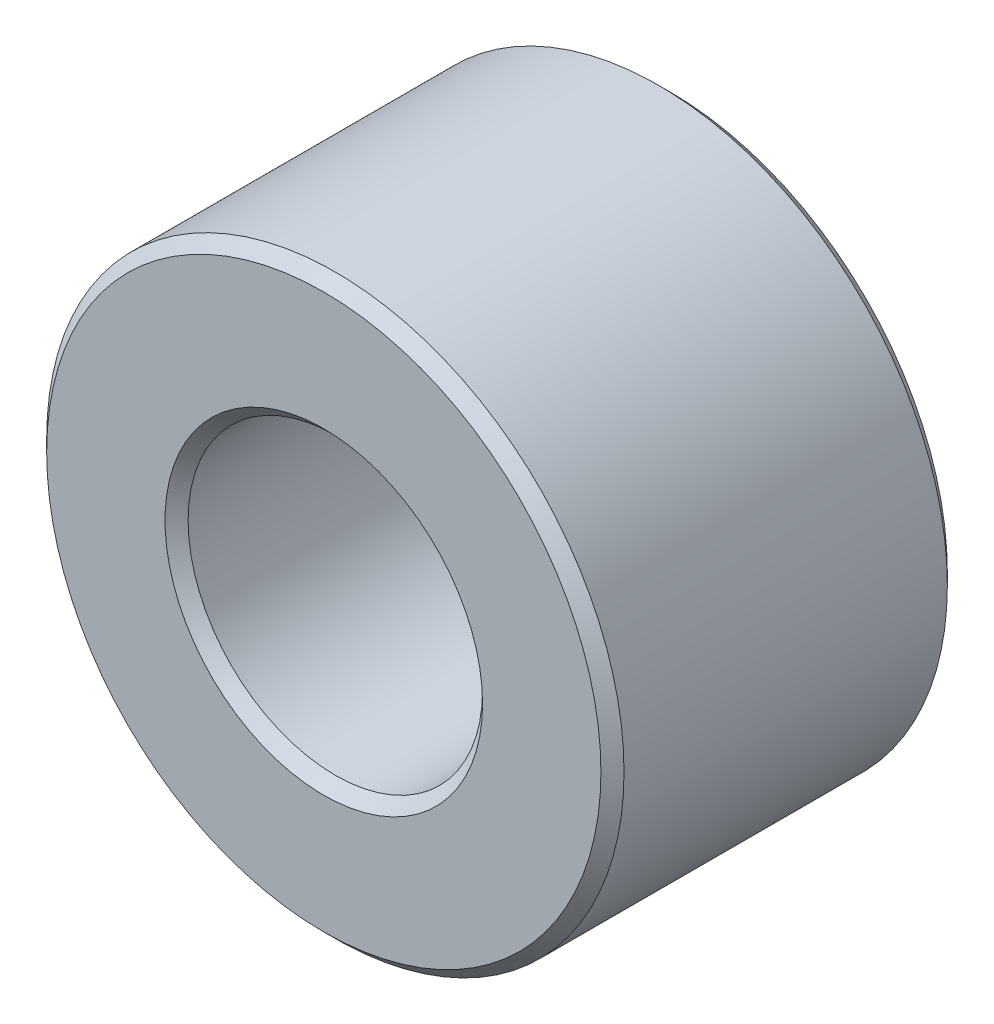
ISO-10303-21;
HEADER;
FILE_DESCRIPTION(('STEP AP214'),'2;1');
FILE_NAME('part.step','',(''),(''),'','','');
FILE_SCHEMA(('AUTOMOTIVE_DESIGN { 1 0 10303 214 1 1 1 1 }'));
ENDSEC;
DATA;
#1=APPLICATION_CONTEXT('core data for automotive mechanical design processes');
#2=APPLICATION_PROTOCOL_DEFINITION('international standard','automotive_design',2000,#1);
#3=PRODUCT_CONTEXT('',#1,'mechanical');
#4=PRODUCT('Part','Part','',(#3));
#5=PRODUCT_RELATED_PRODUCT_CATEGORY('part','',(#4));
#6=PRODUCT_DEFINITION_FORMATION('','',#4);
#7=PRODUCT_DEFINITION_CONTEXT('part definition',#1,'design');
#8=PRODUCT_DEFINITION('design','',#6,#7);
#9=PRODUCT_DEFINITION_SHAPE('','',#8);
#10=(LENGTH_UNIT() NAMED_UNIT(*) SI_UNIT(.MILLI.,.METRE.));
#11=(NAMED_UNIT(*) PLANE_ANGLE_UNIT() SI_UNIT($,.RADIAN.));
#12=(NAMED_UNIT(*) SI_UNIT($,.STERADIAN.) SOLID_ANGLE_UNIT());
#13=UNCERTAINTY_MEASURE_WITH_UNIT(LENGTH_MEASURE(1.E-05),#10,'distance_accuracy_value','');
#14=(GEOMETRIC_REPRESENTATION_CONTEXT(3) GLOBAL_UNCERTAINTY_ASSIGNED_CONTEXT((#13)) GLOBAL_UNIT_ASSIGNED_CONTEXT((#10,
#11,#12)) REPRESENTATION_CONTEXT('',''));
#15=CARTESIAN_POINT('',(0.,0.,0.));
#16=DIRECTION('',(0.,0.,1.));
#17=DIRECTION('',(1.,0.,0.));
#18=AXIS2_PLACEMENT_3D('',#15,#16,#17);
#19=CARTESIAN_POINT('',(0.,0.,6.));
#20=DIRECTION('',(0.,0.,1.));
#21=DIRECTION('',(1.,0.,0.));
#22=AXIS2_PLACEMENT_3D('',#19,#20,#21);
#23=PLANE('',#22);
#24=CARTESIAN_POINT('',(0.,0.,6.));
#25=DIRECTION('',(0.,0.,1.));
#26=DIRECTION('',(1.,0.,0.));
#27=AXIS2_PLACEMENT_3D('',#24,#25,#26);
#28=CIRCLE('',#27,2.75);
#29=CARTESIAN_POINT('',(2.75,0.,6.));
#30=VERTEX_POINT('',#29);
#31=EDGE_CURVE('E10',#30,#30,#28,.F.);
#32=ORIENTED_EDGE('',*,*,#31,.T.);
#33=EDGE_LOOP('',(#32));
#34=FACE_BOUND('',#33,.T.);
#35=CARTESIAN_POINT('',(0.,0.,6.));
#36=DIRECTION('',(0.,0.,1.));
#37=DIRECTION('',(1.,0.,0.));
#38=AXIS2_PLACEMENT_3D('',#35,#36,#37);
#39=CIRCLE('',#38,4.8);
#40=CARTESIAN_POINT('',(4.8,0.,6.));
#41=VERTEX_POINT('',#40);
#42=EDGE_CURVE('E44',#41,#41,#39,.T.);
#43=ORIENTED_EDGE('',*,*,#42,.T.);
#44=EDGE_LOOP('',(#43));
#45=FACE_BOUND('',#44,.T.);
#46=ADVANCED_FACE('F36',(#34,#45),#23,.T.);
#47=CARTESIAN_POINT('',(0.,0.,0.));
#48=DIRECTION('',(0.,0.,1.));
#49=DIRECTION('',(1.,0.,0.));
#50=AXIS2_PLACEMENT_3D('',#47,#48,#49);
#51=PLANE('',#50);
#52=CARTESIAN_POINT('',(0.,0.,0.));
#53=DIRECTION('',(0.,0.,1.));
#54=DIRECTION('',(1.,0.,0.));
#55=AXIS2_PLACEMENT_3D('',#52,#53,#54);
#56=CIRCLE('',#55,4.8);
#57=CARTESIAN_POINT('',(4.8,0.,0.));
#58=VERTEX_POINT('',#57);
#59=EDGE_CURVE('E61',#58,#58,#56,.F.);
#60=ORIENTED_EDGE('',*,*,#59,.T.);
#61=EDGE_LOOP('',(#60));
#62=FACE_BOUND('',#61,.T.);
#63=CARTESIAN_POINT('',(0.,0.,0.));
#64=DIRECTION('',(0.,0.,1.));
#65=DIRECTION('',(1.,0.,0.));
#66=AXIS2_PLACEMENT_3D('',#63,#64,#65);
#67=CIRCLE('',#66,2.75);
#68=CARTESIAN_POINT('',(2.75,0.,0.));
#69=VERTEX_POINT('',#68);
#70=EDGE_CURVE('E65',#69,#69,#67,.T.);
#71=ORIENTED_EDGE('',*,*,#70,.T.);
#72=EDGE_LOOP('',(#71));
#73=FACE_BOUND('',#72,.T.);
#74=ADVANCED_FACE('F88',(#62,#73),#51,.F.);
#75=CARTESIAN_POINT('',(0.,0.,6.));
#76=DIRECTION('',(0.,0.,-1.));
#77=DIRECTION('',(-1.,0.,0.));
#78=AXIS2_PLACEMENT_3D('',#75,#76,#77);
#79=CYLINDRICAL_SURFACE('',#78,5.);
#80=CARTESIAN_POINT('',(0.,0.,0.199999999999998));
#81=DIRECTION('',(0.,0.,1.));
#82=DIRECTION('',(1.,0.,0.));
#83=AXIS2_PLACEMENT_3D('',#80,#81,#82);
#84=CIRCLE('',#83,5.);
#85=CARTESIAN_POINT('',(5.,0.,0.199999999999998));
#86=VERTEX_POINT('',#85);
#87=EDGE_CURVE('E69',#86,#86,#84,.T.);
#88=ORIENTED_EDGE('',*,*,#87,.T.);
#89=EDGE_LOOP('',(#88));
#90=FACE_BOUND('',#89,.T.);
#91=CARTESIAN_POINT('',(0.,0.,5.8));
#92=DIRECTION('',(0.,0.,1.));
#93=DIRECTION('',(1.,0.,0.));
#94=AXIS2_PLACEMENT_3D('',#91,#92,#93);
#95=CIRCLE('',#94,5.);
#96=CARTESIAN_POINT('',(5.,0.,5.8));
#97=VERTEX_POINT('',#96);
#98=EDGE_CURVE('E73',#97,#97,#95,.F.);
#99=ORIENTED_EDGE('',*,*,#98,.T.);
#100=EDGE_LOOP('',(#99));
#101=FACE_BOUND('',#100,.T.);
#102=ADVANCED_FACE('F77',(#90,#101),#79,.T.);
#103=CARTESIAN_POINT('',(0.,0.,6.));
#104=DIRECTION('',(0.,0.,-1.));
#105=DIRECTION('',(-1.,0.,0.));
#106=AXIS2_PLACEMENT_3D('',#103,#104,#105);
#107=CYLINDRICAL_SURFACE('',#106,2.55);
#108=CARTESIAN_POINT('',(0.,0.,0.200000000000003));
#109=DIRECTION('',(0.,0.,1.));
#110=DIRECTION('',(1.,0.,0.));
#111=AXIS2_PLACEMENT_3D('',#108,#109,#110);
#112=CIRCLE('',#111,2.55);
#113=CARTESIAN_POINT('',(2.55,0.,0.200000000000003));
#114=VERTEX_POINT('',#113);
#115=EDGE_CURVE('E50',#114,#114,#112,.F.);
#116=ORIENTED_EDGE('',*,*,#115,.T.);
#117=EDGE_LOOP('',(#116));
#118=FACE_BOUND('',#117,.T.);
#119=CARTESIAN_POINT('',(0.,0.,5.8));
#120=DIRECTION('',(0.,0.,1.));
#121=DIRECTION('',(1.,0.,0.));
#122=AXIS2_PLACEMENT_3D('',#119,#120,#121);
#123=CIRCLE('',#122,2.55);
#124=CARTESIAN_POINT('',(2.55,0.,5.8));
#125=VERTEX_POINT('',#124);
#126=EDGE_CURVE('E56',#125,#125,#123,.T.);
#127=ORIENTED_EDGE('',*,*,#126,.T.);
#128=EDGE_LOOP('',(#127));
#129=FACE_BOUND('',#128,.T.);
#130=ADVANCED_FACE('F96',(#118,#129),#107,.F.);
#131=CARTESIAN_POINT('',(0.,0.,0.199999999999998));
#132=DIRECTION('',(0.,0.,1.));
#133=DIRECTION('',(1.,0.,0.));
#134=AXIS2_PLACEMENT_3D('',#131,#132,#133);
#135=CONICAL_SURFACE('',#134,5.,0.785398163397455);
#136=ORIENTED_EDGE('',*,*,#59,.F.);
#137=EDGE_LOOP('',(#136));
#138=FACE_BOUND('',#137,.T.);
#139=ORIENTED_EDGE('',*,*,#87,.F.);
#140=EDGE_LOOP('',(#139));
#141=FACE_BOUND('',#140,.T.);
#142=ADVANCED_FACE('F101',(#138,#141),#135,.T.);
#143=CARTESIAN_POINT('',(0.,0.,0.));
#144=DIRECTION('',(0.,0.,-1.));
#145=DIRECTION('',(-1.,0.,0.));
#146=AXIS2_PLACEMENT_3D('',#143,#144,#145);
#147=CONICAL_SURFACE('',#146,2.75,0.785398163397443);
#148=ORIENTED_EDGE('',*,*,#115,.F.);
#149=EDGE_LOOP('',(#148));
#150=FACE_BOUND('',#149,.T.);
#151=ORIENTED_EDGE('',*,*,#70,.F.);
#152=EDGE_LOOP('',(#151));
#153=FACE_BOUND('',#152,.T.);
#154=ADVANCED_FACE('F85',(#150,#153),#147,.F.);
#155=CARTESIAN_POINT('',(0.,0.,5.8));
#156=DIRECTION('',(0.,0.,1.));
#157=DIRECTION('',(1.,0.,0.));
#158=AXIS2_PLACEMENT_3D('',#155,#156,#157);
#159=CONICAL_SURFACE('',#158,2.55,0.785398163397454);
#160=ORIENTED_EDGE('',*,*,#31,.F.);
#161=EDGE_LOOP('',(#160));
#162=FACE_BOUND('',#161,.T.);
#163=ORIENTED_EDGE('',*,*,#126,.F.);
#164=EDGE_LOOP('',(#163));
#165=FACE_BOUND('',#164,.T.);
#166=ADVANCED_FACE('F81',(#162,#165),#159,.F.);
#167=CARTESIAN_POINT('',(0.,0.,6.));
#168=DIRECTION('',(0.,0.,-1.));
#169=DIRECTION('',(-1.,0.,0.));
#170=AXIS2_PLACEMENT_3D('',#167,#168,#169);
#171=CONICAL_SURFACE('',#170,4.8,0.785398163397448);
#172=ORIENTED_EDGE('',*,*,#98,.F.);
#173=EDGE_LOOP('',(#172));
#174=FACE_BOUND('',#173,.T.);
#175=ORIENTED_EDGE('',*,*,#42,.F.);
#176=EDGE_LOOP('',(#175));
#177=FACE_BOUND('',#176,.T.);
#178=ADVANCED_FACE('F38',(#174,#177),#171,.T.);
#179=CLOSED_SHELL('',(#46,#74,#102,#130,#142,#154,#166,#178));
#180=MANIFOLD_SOLID_BREP('B2',#179);
#181=ADVANCED_BREP_SHAPE_REPRESENTATION('',(#18,#180),#14);
#182=SHAPE_DEFINITION_REPRESENTATION(#9,#181);
ENDSEC;
END-ISO-10303-21;
